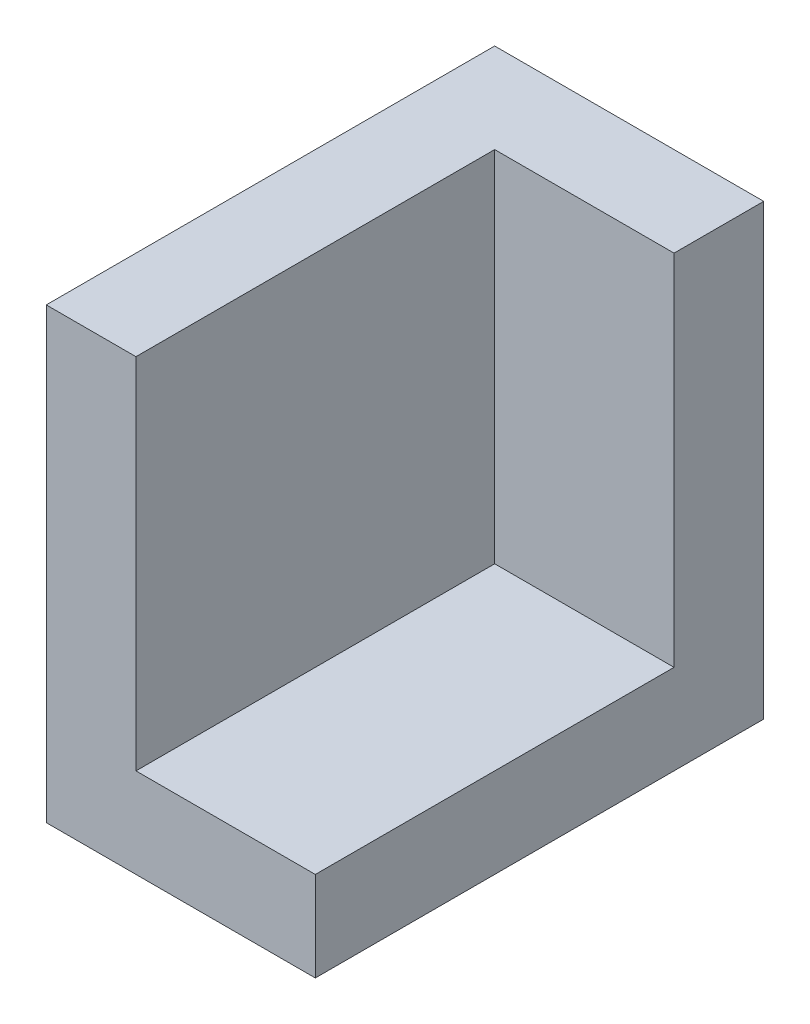
ISO-10303-21;
HEADER;
FILE_DESCRIPTION(('STEP AP214'),'2;1');
FILE_NAME('part.step','',(''),(''),'','','');
FILE_SCHEMA(('AUTOMOTIVE_DESIGN { 1 0 10303 214 1 1 1 1 }'));
ENDSEC;
DATA;
#1=APPLICATION_CONTEXT('core data for automotive mechanical design processes');
#2=APPLICATION_PROTOCOL_DEFINITION('international standard','automotive_design',2000,#1);
#3=PRODUCT_CONTEXT('',#1,'mechanical');
#4=PRODUCT('Part','Part','',(#3));
#5=PRODUCT_RELATED_PRODUCT_CATEGORY('part','',(#4));
#6=PRODUCT_DEFINITION_FORMATION('','',#4);
#7=PRODUCT_DEFINITION_CONTEXT('part definition',#1,'design');
#8=PRODUCT_DEFINITION('design','',#6,#7);
#9=PRODUCT_DEFINITION_SHAPE('','',#8);
#10=(LENGTH_UNIT() NAMED_UNIT(*) SI_UNIT(.MILLI.,.METRE.));
#11=(NAMED_UNIT(*) PLANE_ANGLE_UNIT() SI_UNIT($,.RADIAN.));
#12=(NAMED_UNIT(*) SI_UNIT($,.STERADIAN.) SOLID_ANGLE_UNIT());
#13=UNCERTAINTY_MEASURE_WITH_UNIT(LENGTH_MEASURE(1.E-05),#10,'distance_accuracy_value','');
#14=(GEOMETRIC_REPRESENTATION_CONTEXT(3) GLOBAL_UNCERTAINTY_ASSIGNED_CONTEXT((#13)) GLOBAL_UNIT_ASSIGNED_CONTEXT((#10,
#11,#12)) REPRESENTATION_CONTEXT('',''));
#15=CARTESIAN_POINT('',(0.,0.,0.));
#16=DIRECTION('',(0.,0.,1.));
#17=DIRECTION('',(1.,0.,0.));
#18=AXIS2_PLACEMENT_3D('',#15,#16,#17);
#19=CARTESIAN_POINT('',(10.,0.,20.));
#20=DIRECTION('',(0.,-1.,0.));
#21=DIRECTION('',(0.,0.,-1.));
#22=AXIS2_PLACEMENT_3D('',#19,#20,#21);
#23=PLANE('',#22);
#24=DIRECTION('',(0.,0.,1.));
#25=VECTOR('',#24,1.);
#26=CARTESIAN_POINT('',(0.,0.,20.));
#27=LINE('',#26,#25);
#28=CARTESIAN_POINT('',(0.,0.,0.));
#29=VERTEX_POINT('',#28);
#30=CARTESIAN_POINT('',(0.,0.,20.));
#31=VERTEX_POINT('',#30);
#32=EDGE_CURVE('E120',#29,#31,#27,.T.);
#33=ORIENTED_EDGE('',*,*,#32,.T.);
#34=DIRECTION('',(-1.,0.,0.));
#35=VECTOR('',#34,1.);
#36=CARTESIAN_POINT('',(10.,0.,20.));
#37=LINE('',#36,#35);
#38=CARTESIAN_POINT('',(10.,0.,20.));
#39=VERTEX_POINT('',#38);
#40=EDGE_CURVE('E11',#39,#31,#37,.T.);
#41=ORIENTED_EDGE('',*,*,#40,.F.);
#42=DIRECTION('',(0.,0.,1.));
#43=VECTOR('',#42,1.);
#44=CARTESIAN_POINT('',(10.,0.,20.));
#45=LINE('',#44,#43);
#46=CARTESIAN_POINT('',(10.,0.,0.));
#47=VERTEX_POINT('',#46);
#48=EDGE_CURVE('E121',#47,#39,#45,.T.);
#49=ORIENTED_EDGE('',*,*,#48,.F.);
#50=DIRECTION('',(-1.,0.,0.));
#51=VECTOR('',#50,1.);
#52=CARTESIAN_POINT('',(10.,0.,0.));
#53=LINE('',#52,#51);
#54=EDGE_CURVE('E132',#47,#29,#53,.T.);
#55=ORIENTED_EDGE('',*,*,#54,.T.);
#56=EDGE_LOOP('',(#33,#41,#49,#55));
#57=FACE_BOUND('',#56,.T.);
#58=ADVANCED_FACE('F33',(#57),#23,.F.);
#59=CARTESIAN_POINT('',(10.,-5.,20.));
#60=DIRECTION('',(0.,0.,-1.));
#61=DIRECTION('',(-1.,0.,0.));
#62=AXIS2_PLACEMENT_3D('',#59,#60,#61);
#63=PLANE('',#62);
#64=ORIENTED_EDGE('',*,*,#40,.T.);
#65=DIRECTION('',(0.,-1.,0.));
#66=VECTOR('',#65,1.);
#67=CARTESIAN_POINT('',(0.,20.,20.));
#68=LINE('',#67,#66);
#69=CARTESIAN_POINT('',(0.,20.,20.));
#70=VERTEX_POINT('',#69);
#71=EDGE_CURVE('E112',#70,#31,#68,.T.);
#72=ORIENTED_EDGE('',*,*,#71,.F.);
#73=DIRECTION('',(1.,0.,0.));
#74=VECTOR('',#73,1.);
#75=CARTESIAN_POINT('',(-5.,20.,20.));
#76=LINE('',#75,#74);
#77=CARTESIAN_POINT('',(-5.,20.,20.));
#78=VERTEX_POINT('',#77);
#79=EDGE_CURVE('E109',#78,#70,#76,.T.);
#80=ORIENTED_EDGE('',*,*,#79,.F.);
#81=DIRECTION('',(0.,-1.,0.));
#82=VECTOR('',#81,1.);
#83=CARTESIAN_POINT('',(-5.,20.,20.));
#84=LINE('',#83,#82);
#85=CARTESIAN_POINT('',(-5.,-5.,20.));
#86=VERTEX_POINT('',#85);
#87=EDGE_CURVE('E101',#78,#86,#84,.T.);
#88=ORIENTED_EDGE('',*,*,#87,.T.);
#89=DIRECTION('',(-1.,0.,0.));
#90=VECTOR('',#89,1.);
#91=CARTESIAN_POINT('',(10.,-5.,20.));
#92=LINE('',#91,#90);
#93=CARTESIAN_POINT('',(10.,-5.,20.));
#94=VERTEX_POINT('',#93);
#95=EDGE_CURVE('E41',#94,#86,#92,.T.);
#96=ORIENTED_EDGE('',*,*,#95,.F.);
#97=DIRECTION('',(0.,-1.,0.));
#98=VECTOR('',#97,1.);
#99=CARTESIAN_POINT('',(10.,-5.,20.));
#100=LINE('',#99,#98);
#101=EDGE_CURVE('E123',#39,#94,#100,.T.);
#102=ORIENTED_EDGE('',*,*,#101,.F.);
#103=EDGE_LOOP('',(#64,#72,#80,#88,#96,#102));
#104=FACE_BOUND('',#103,.T.);
#105=ADVANCED_FACE('F106',(#104),#63,.F.);
#106=CARTESIAN_POINT('',(10.,-5.,-5.));
#107=DIRECTION('',(0.,1.,0.));
#108=DIRECTION('',(0.,0.,1.));
#109=AXIS2_PLACEMENT_3D('',#106,#107,#108);
#110=PLANE('',#109);
#111=ORIENTED_EDGE('',*,*,#95,.T.);
#112=DIRECTION('',(0.,0.,-1.));
#113=VECTOR('',#112,1.);
#114=CARTESIAN_POINT('',(-5.,-5.,20.));
#115=LINE('',#114,#113);
#116=CARTESIAN_POINT('',(-5.,-5.,-5.));
#117=VERTEX_POINT('',#116);
#118=EDGE_CURVE('E91',#86,#117,#115,.T.);
#119=ORIENTED_EDGE('',*,*,#118,.T.);
#120=DIRECTION('',(-1.,0.,0.));
#121=VECTOR('',#120,1.);
#122=CARTESIAN_POINT('',(10.,-5.,-5.));
#123=LINE('',#122,#121);
#124=CARTESIAN_POINT('',(10.,-5.,-5.));
#125=VERTEX_POINT('',#124);
#126=EDGE_CURVE('E95',#125,#117,#123,.T.);
#127=ORIENTED_EDGE('',*,*,#126,.F.);
#128=DIRECTION('',(0.,0.,-1.));
#129=VECTOR('',#128,1.);
#130=CARTESIAN_POINT('',(10.,-5.,-5.));
#131=LINE('',#130,#129);
#132=EDGE_CURVE('E92',#94,#125,#131,.T.);
#133=ORIENTED_EDGE('',*,*,#132,.F.);
#134=EDGE_LOOP('',(#111,#119,#127,#133));
#135=FACE_BOUND('',#134,.T.);
#136=ADVANCED_FACE('F89',(#135),#110,.F.);
#137=CARTESIAN_POINT('',(10.,20.,-5.));
#138=DIRECTION('',(0.,0.,1.));
#139=DIRECTION('',(0.,-1.,0.));
#140=AXIS2_PLACEMENT_3D('',#137,#138,#139);
#141=PLANE('',#140);
#142=ORIENTED_EDGE('',*,*,#126,.T.);
#143=DIRECTION('',(0.,1.,0.));
#144=VECTOR('',#143,1.);
#145=CARTESIAN_POINT('',(-5.,-5.,-5.));
#146=LINE('',#145,#144);
#147=CARTESIAN_POINT('',(-5.,20.,-5.));
#148=VERTEX_POINT('',#147);
#149=EDGE_CURVE('E104',#117,#148,#146,.T.);
#150=ORIENTED_EDGE('',*,*,#149,.T.);
#151=DIRECTION('',(-1.,0.,0.));
#152=VECTOR('',#151,1.);
#153=CARTESIAN_POINT('',(10.,20.,-5.));
#154=LINE('',#153,#152);
#155=CARTESIAN_POINT('',(10.,20.,-5.));
#156=VERTEX_POINT('',#155);
#157=EDGE_CURVE('E142',#156,#148,#154,.T.);
#158=ORIENTED_EDGE('',*,*,#157,.F.);
#159=DIRECTION('',(0.,1.,0.));
#160=VECTOR('',#159,1.);
#161=CARTESIAN_POINT('',(10.,20.,-5.));
#162=LINE('',#161,#160);
#163=EDGE_CURVE('E127',#125,#156,#162,.T.);
#164=ORIENTED_EDGE('',*,*,#163,.F.);
#165=EDGE_LOOP('',(#142,#150,#158,#164));
#166=FACE_BOUND('',#165,.T.);
#167=ADVANCED_FACE('F146',(#166),#141,.F.);
#168=CARTESIAN_POINT('',(10.,20.,0.));
#169=DIRECTION('',(0.,-1.,0.));
#170=DIRECTION('',(0.,0.,-1.));
#171=AXIS2_PLACEMENT_3D('',#168,#169,#170);
#172=PLANE('',#171);
#173=ORIENTED_EDGE('',*,*,#157,.T.);
#174=DIRECTION('',(0.,0.,1.));
#175=VECTOR('',#174,1.);
#176=CARTESIAN_POINT('',(-5.,20.,-5.));
#177=LINE('',#176,#175);
#178=EDGE_CURVE('E116',#148,#78,#177,.T.);
#179=ORIENTED_EDGE('',*,*,#178,.T.);
#180=ORIENTED_EDGE('',*,*,#79,.T.);
#181=DIRECTION('',(0.,0.,1.));
#182=VECTOR('',#181,1.);
#183=CARTESIAN_POINT('',(0.,20.,-5.));
#184=LINE('',#183,#182);
#185=CARTESIAN_POINT('',(0.,20.,0.));
#186=VERTEX_POINT('',#185);
#187=EDGE_CURVE('E110',#186,#70,#184,.T.);
#188=ORIENTED_EDGE('',*,*,#187,.F.);
#189=DIRECTION('',(-1.,0.,0.));
#190=VECTOR('',#189,1.);
#191=CARTESIAN_POINT('',(10.,20.,0.));
#192=LINE('',#191,#190);
#193=CARTESIAN_POINT('',(10.,20.,0.));
#194=VERTEX_POINT('',#193);
#195=EDGE_CURVE('E139',#194,#186,#192,.T.);
#196=ORIENTED_EDGE('',*,*,#195,.F.);
#197=DIRECTION('',(0.,0.,1.));
#198=VECTOR('',#197,1.);
#199=CARTESIAN_POINT('',(10.,20.,0.));
#200=LINE('',#199,#198);
#201=EDGE_CURVE('E129',#156,#194,#200,.T.);
#202=ORIENTED_EDGE('',*,*,#201,.F.);
#203=EDGE_LOOP('',(#173,#179,#180,#188,#196,#202));
#204=FACE_BOUND('',#203,.T.);
#205=ADVANCED_FACE('F161',(#204),#172,.F.);
#206=CARTESIAN_POINT('',(10.,0.,0.));
#207=DIRECTION('',(0.,0.,-1.));
#208=DIRECTION('',(-1.,0.,0.));
#209=AXIS2_PLACEMENT_3D('',#206,#207,#208);
#210=PLANE('',#209);
#211=DIRECTION('',(0.,-1.,0.));
#212=VECTOR('',#211,1.);
#213=CARTESIAN_POINT('',(0.,0.,0.));
#214=LINE('',#213,#212);
#215=EDGE_CURVE('E124',#186,#29,#214,.T.);
#216=ORIENTED_EDGE('',*,*,#215,.T.);
#217=ORIENTED_EDGE('',*,*,#54,.F.);
#218=DIRECTION('',(0.,-1.,0.));
#219=VECTOR('',#218,1.);
#220=CARTESIAN_POINT('',(10.,0.,0.));
#221=LINE('',#220,#219);
#222=EDGE_CURVE('E48',#194,#47,#221,.T.);
#223=ORIENTED_EDGE('',*,*,#222,.F.);
#224=ORIENTED_EDGE('',*,*,#195,.T.);
#225=EDGE_LOOP('',(#216,#217,#223,#224));
#226=FACE_BOUND('',#225,.T.);
#227=ADVANCED_FACE('F159',(#226),#210,.F.);
#228=CARTESIAN_POINT('',(10.,0.,0.));
#229=DIRECTION('',(1.,0.,0.));
#230=DIRECTION('',(0.,0.,-1.));
#231=AXIS2_PLACEMENT_3D('',#228,#229,#230);
#232=PLANE('',#231);
#233=ORIENTED_EDGE('',*,*,#48,.T.);
#234=ORIENTED_EDGE('',*,*,#101,.T.);
#235=ORIENTED_EDGE('',*,*,#132,.T.);
#236=ORIENTED_EDGE('',*,*,#163,.T.);
#237=ORIENTED_EDGE('',*,*,#201,.T.);
#238=ORIENTED_EDGE('',*,*,#222,.T.);
#239=EDGE_LOOP('',(#233,#234,#235,#236,#237,#238));
#240=FACE_BOUND('',#239,.T.);
#241=ADVANCED_FACE('F149',(#240),#232,.T.);
#242=CARTESIAN_POINT('',(0.,0.,0.));
#243=DIRECTION('',(1.,0.,0.));
#244=DIRECTION('',(0.,0.,-1.));
#245=AXIS2_PLACEMENT_3D('',#242,#243,#244);
#246=PLANE('',#245);
#247=ORIENTED_EDGE('',*,*,#32,.F.);
#248=ORIENTED_EDGE('',*,*,#215,.F.);
#249=ORIENTED_EDGE('',*,*,#187,.T.);
#250=ORIENTED_EDGE('',*,*,#71,.T.);
#251=EDGE_LOOP('',(#247,#248,#249,#250));
#252=FACE_BOUND('',#251,.T.);
#253=ADVANCED_FACE('F156',(#252),#246,.T.);
#254=CARTESIAN_POINT('',(-5.,0.,0.));
#255=DIRECTION('',(1.,0.,0.));
#256=DIRECTION('',(0.,0.,-1.));
#257=AXIS2_PLACEMENT_3D('',#254,#255,#256);
#258=PLANE('',#257);
#259=ORIENTED_EDGE('',*,*,#87,.F.);
#260=ORIENTED_EDGE('',*,*,#178,.F.);
#261=ORIENTED_EDGE('',*,*,#149,.F.);
#262=ORIENTED_EDGE('',*,*,#118,.F.);
#263=EDGE_LOOP('',(#259,#260,#261,#262));
#264=FACE_BOUND('',#263,.T.);
#265=ADVANCED_FACE('F99',(#264),#258,.F.);
#266=CLOSED_SHELL('',(#58,#105,#136,#167,#205,#227,#241,#253,#265));
#267=MANIFOLD_SOLID_BREP('B2',#266);
#268=ADVANCED_BREP_SHAPE_REPRESENTATION('',(#18,#267),#14);
#269=SHAPE_DEFINITION_REPRESENTATION(#9,#268);
ENDSEC;
END-ISO-10303-21;
